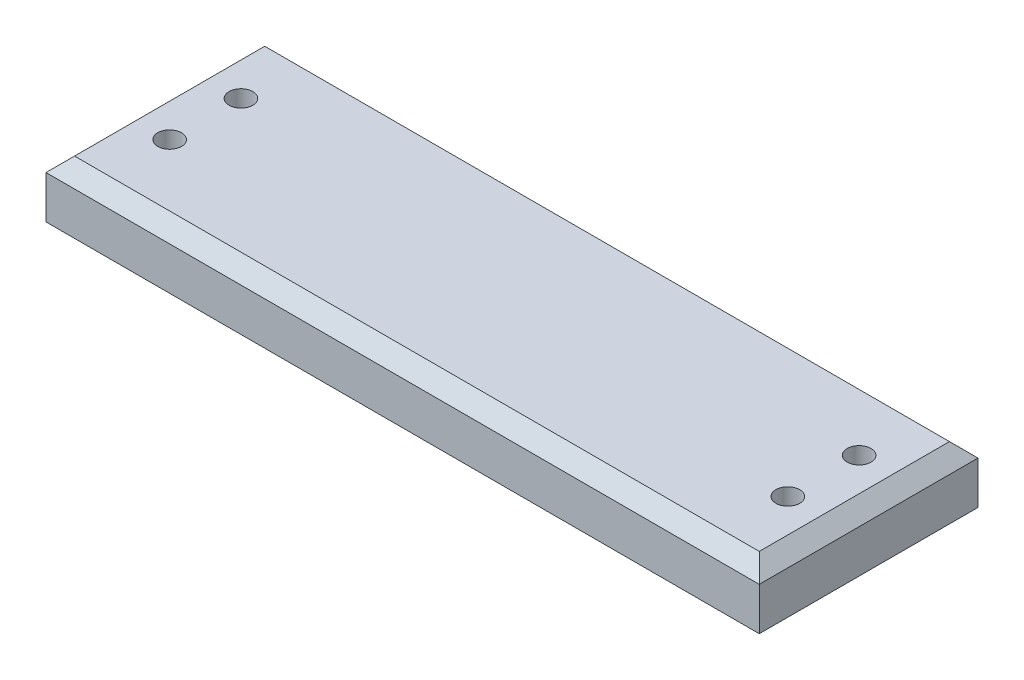
ISO-10303-21;
HEADER;
FILE_DESCRIPTION(('STEP AP214'),'2;1');
FILE_NAME('part.step','',(''),(''),'','','');
FILE_SCHEMA(('AUTOMOTIVE_DESIGN { 1 0 10303 214 1 1 1 1 }'));
ENDSEC;
DATA;
#1=APPLICATION_CONTEXT('core data for automotive mechanical design processes');
#2=APPLICATION_PROTOCOL_DEFINITION('international standard','automotive_design',2000,#1);
#3=PRODUCT_CONTEXT('',#1,'mechanical');
#4=PRODUCT('Part','Part','',(#3));
#5=PRODUCT_RELATED_PRODUCT_CATEGORY('part','',(#4));
#6=PRODUCT_DEFINITION_FORMATION('','',#4);
#7=PRODUCT_DEFINITION_CONTEXT('part definition',#1,'design');
#8=PRODUCT_DEFINITION('design','',#6,#7);
#9=PRODUCT_DEFINITION_SHAPE('','',#8);
#10=(LENGTH_UNIT() NAMED_UNIT(*) SI_UNIT(.MILLI.,.METRE.));
#11=(NAMED_UNIT(*) PLANE_ANGLE_UNIT() SI_UNIT($,.RADIAN.));
#12=(NAMED_UNIT(*) SI_UNIT($,.STERADIAN.) SOLID_ANGLE_UNIT());
#13=UNCERTAINTY_MEASURE_WITH_UNIT(LENGTH_MEASURE(1.E-05),#10,'distance_accuracy_value','');
#14=(GEOMETRIC_REPRESENTATION_CONTEXT(3) GLOBAL_UNCERTAINTY_ASSIGNED_CONTEXT((#13)) GLOBAL_UNIT_ASSIGNED_CONTEXT((#10,
#11,#12)) REPRESENTATION_CONTEXT('',''));
#15=CARTESIAN_POINT('',(0.,0.,0.));
#16=DIRECTION('',(0.,0.,1.));
#17=DIRECTION('',(1.,0.,0.));
#18=AXIS2_PLACEMENT_3D('',#15,#16,#17);
#19=CARTESIAN_POINT('',(1905.,304.8,584.2));
#20=DIRECTION('',(-1.,0.,0.));
#21=DIRECTION('',(0.,0.,1.));
#22=AXIS2_PLACEMENT_3D('',#19,#20,#21);
#23=PLANE('',#22);
#24=DIRECTION('',(0.,-1.,0.));
#25=VECTOR('',#24,1.);
#26=CARTESIAN_POINT('',(1905.,304.8,-584.2));
#27=LINE('',#26,#25);
#28=CARTESIAN_POINT('',(1905.,228.6,-584.2));
#29=VERTEX_POINT('',#28);
#30=CARTESIAN_POINT('',(1905.,0.,-584.2));
#31=VERTEX_POINT('',#30);
#32=EDGE_CURVE('E83',#29,#31,#27,.T.);
#33=ORIENTED_EDGE('',*,*,#32,.F.);
#34=DIRECTION('',(0.,0.,1.));
#35=VECTOR('',#34,1.);
#36=CARTESIAN_POINT('',(1905.,228.6,584.2));
#37=LINE('',#36,#35);
#38=CARTESIAN_POINT('',(1905.,228.6,584.2));
#39=VERTEX_POINT('',#38);
#40=EDGE_CURVE('E134',#29,#39,#37,.T.);
#41=ORIENTED_EDGE('',*,*,#40,.T.);
#42=DIRECTION('',(0.,-1.,0.));
#43=VECTOR('',#42,1.);
#44=CARTESIAN_POINT('',(1905.,304.8,584.2));
#45=LINE('',#44,#43);
#46=CARTESIAN_POINT('',(1905.,0.,584.2));
#47=VERTEX_POINT('',#46);
#48=EDGE_CURVE('E103',#39,#47,#45,.T.);
#49=ORIENTED_EDGE('',*,*,#48,.T.);
#50=DIRECTION('',(0.,0.,-1.));
#51=VECTOR('',#50,1.);
#52=CARTESIAN_POINT('',(1905.,0.,584.2));
#53=LINE('',#52,#51);
#54=EDGE_CURVE('E98',#47,#31,#53,.T.);
#55=ORIENTED_EDGE('',*,*,#54,.T.);
#56=EDGE_LOOP('',(#33,#41,#49,#55));
#57=FACE_BOUND('',#56,.T.);
#58=ADVANCED_FACE('F31',(#57),#23,.F.);
#59=CARTESIAN_POINT('',(-1905.,304.8,-584.2));
#60=DIRECTION('',(0.,0.,1.));
#61=DIRECTION('',(1.,0.,0.));
#62=AXIS2_PLACEMENT_3D('',#59,#60,#61);
#63=PLANE('',#62);
#64=DIRECTION('',(0.,-1.,0.));
#65=VECTOR('',#64,1.);
#66=CARTESIAN_POINT('',(-1905.,304.8,-584.2));
#67=LINE('',#66,#65);
#68=CARTESIAN_POINT('',(-1905.,228.6,-584.2));
#69=VERTEX_POINT('',#68);
#70=CARTESIAN_POINT('',(-1905.,0.,-584.2));
#71=VERTEX_POINT('',#70);
#72=EDGE_CURVE('E92',#69,#71,#67,.T.);
#73=ORIENTED_EDGE('',*,*,#72,.F.);
#74=DIRECTION('',(1.,0.,0.));
#75=VECTOR('',#74,1.);
#76=CARTESIAN_POINT('',(-1905.,228.6,-584.2));
#77=LINE('',#76,#75);
#78=EDGE_CURVE('E46',#69,#29,#77,.T.);
#79=ORIENTED_EDGE('',*,*,#78,.T.);
#80=ORIENTED_EDGE('',*,*,#32,.T.);
#81=DIRECTION('',(-1.,0.,0.));
#82=VECTOR('',#81,1.);
#83=CARTESIAN_POINT('',(-1905.,0.,-584.2));
#84=LINE('',#83,#82);
#85=EDGE_CURVE('E86',#31,#71,#84,.T.);
#86=ORIENTED_EDGE('',*,*,#85,.T.);
#87=EDGE_LOOP('',(#73,#79,#80,#86));
#88=FACE_BOUND('',#87,.T.);
#89=ADVANCED_FACE('F85',(#88),#63,.F.);
#90=CARTESIAN_POINT('',(-1905.,304.8,584.2));
#91=DIRECTION('',(1.,0.,0.));
#92=DIRECTION('',(0.,0.,-1.));
#93=AXIS2_PLACEMENT_3D('',#90,#91,#92);
#94=PLANE('',#93);
#95=DIRECTION('',(0.,-1.,0.));
#96=VECTOR('',#95,1.);
#97=CARTESIAN_POINT('',(-1905.,304.8,584.2));
#98=LINE('',#97,#96);
#99=CARTESIAN_POINT('',(-1905.,228.6,584.2));
#100=VERTEX_POINT('',#99);
#101=CARTESIAN_POINT('',(-1905.,0.,584.2));
#102=VERTEX_POINT('',#101);
#103=EDGE_CURVE('E118',#100,#102,#98,.T.);
#104=ORIENTED_EDGE('',*,*,#103,.F.);
#105=DIRECTION('',(0.,0.,-1.));
#106=VECTOR('',#105,1.);
#107=CARTESIAN_POINT('',(-1905.,228.6,584.2));
#108=LINE('',#107,#106);
#109=EDGE_CURVE('E54',#100,#69,#108,.T.);
#110=ORIENTED_EDGE('',*,*,#109,.T.);
#111=ORIENTED_EDGE('',*,*,#72,.T.);
#112=DIRECTION('',(0.,0.,1.));
#113=VECTOR('',#112,1.);
#114=CARTESIAN_POINT('',(-1905.,0.,584.2));
#115=LINE('',#114,#113);
#116=EDGE_CURVE('E100',#71,#102,#115,.T.);
#117=ORIENTED_EDGE('',*,*,#116,.T.);
#118=EDGE_LOOP('',(#104,#110,#111,#117));
#119=FACE_BOUND('',#118,.T.);
#120=ADVANCED_FACE('F189',(#119),#94,.F.);
#121=CARTESIAN_POINT('',(-1905.,304.8,584.2));
#122=DIRECTION('',(0.,0.,-1.));
#123=DIRECTION('',(-1.,0.,0.));
#124=AXIS2_PLACEMENT_3D('',#121,#122,#123);
#125=PLANE('',#124);
#126=ORIENTED_EDGE('',*,*,#48,.F.);
#127=DIRECTION('',(-1.,0.,0.));
#128=VECTOR('',#127,1.);
#129=CARTESIAN_POINT('',(-1905.,228.6,584.2));
#130=LINE('',#129,#128);
#131=EDGE_CURVE('E129',#39,#100,#130,.T.);
#132=ORIENTED_EDGE('',*,*,#131,.T.);
#133=ORIENTED_EDGE('',*,*,#103,.T.);
#134=DIRECTION('',(1.,0.,0.));
#135=VECTOR('',#134,1.);
#136=CARTESIAN_POINT('',(-1905.,0.,584.2));
#137=LINE('',#136,#135);
#138=EDGE_CURVE('E115',#102,#47,#137,.T.);
#139=ORIENTED_EDGE('',*,*,#138,.T.);
#140=EDGE_LOOP('',(#126,#132,#133,#139));
#141=FACE_BOUND('',#140,.T.);
#142=ADVANCED_FACE('F240',(#141),#125,.F.);
#143=CARTESIAN_POINT('',(1905.,304.8,-584.2));
#144=DIRECTION('',(0.,-1.,0.));
#145=DIRECTION('',(0.,0.,-1.));
#146=AXIS2_PLACEMENT_3D('',#143,#144,#145);
#147=PLANE('',#146);
#148=CARTESIAN_POINT('',(1651.,304.8,177.8));
#149=DIRECTION('',(0.,1.,0.));
#150=DIRECTION('',(0.,0.,1.));
#151=AXIS2_PLACEMENT_3D('',#148,#149,#150);
#152=CIRCLE('',#151,63.5000000000001);
#153=CARTESIAN_POINT('',(1651.,304.8,241.3));
#154=VERTEX_POINT('',#153);
#155=EDGE_CURVE('E232',#154,#154,#152,.T.);
#156=ORIENTED_EDGE('',*,*,#155,.F.);
#157=EDGE_LOOP('',(#156));
#158=FACE_BOUND('',#157,.T.);
#159=CARTESIAN_POINT('',(1651.,304.8,-203.2));
#160=DIRECTION('',(0.,1.,0.));
#161=DIRECTION('',(0.,0.,1.));
#162=AXIS2_PLACEMENT_3D('',#159,#160,#161);
#163=CIRCLE('',#162,63.5000000000001);
#164=CARTESIAN_POINT('',(1651.,304.8,-139.7));
#165=VERTEX_POINT('',#164);
#166=EDGE_CURVE('E229',#165,#165,#163,.T.);
#167=ORIENTED_EDGE('',*,*,#166,.F.);
#168=EDGE_LOOP('',(#167));
#169=FACE_BOUND('',#168,.T.);
#170=CARTESIAN_POINT('',(-1651.,304.8,-203.2));
#171=DIRECTION('',(0.,1.,0.));
#172=DIRECTION('',(0.,0.,1.));
#173=AXIS2_PLACEMENT_3D('',#170,#171,#172);
#174=CIRCLE('',#173,63.5000000000001);
#175=CARTESIAN_POINT('',(-1651.,304.8,-139.7));
#176=VERTEX_POINT('',#175);
#177=EDGE_CURVE('E231',#176,#176,#174,.T.);
#178=ORIENTED_EDGE('',*,*,#177,.F.);
#179=EDGE_LOOP('',(#178));
#180=FACE_BOUND('',#179,.T.);
#181=CARTESIAN_POINT('',(-1651.,304.8,177.8));
#182=DIRECTION('',(0.,1.,0.));
#183=DIRECTION('',(0.,0.,1.));
#184=AXIS2_PLACEMENT_3D('',#181,#182,#183);
#185=CIRCLE('',#184,63.5000000000001);
#186=CARTESIAN_POINT('',(-1651.,304.8,241.300000000001));
#187=VERTEX_POINT('',#186);
#188=EDGE_CURVE('E111',#187,#187,#185,.T.);
#189=ORIENTED_EDGE('',*,*,#188,.F.);
#190=EDGE_LOOP('',(#189));
#191=FACE_BOUND('',#190,.T.);
#192=DIRECTION('',(0.,0.,1.));
#193=VECTOR('',#192,1.);
#194=CARTESIAN_POINT('',(-1828.8,304.8,-584.2));
#195=LINE('',#194,#193);
#196=CARTESIAN_POINT('',(-1828.8,304.8,-508.));
#197=VERTEX_POINT('',#196);
#198=CARTESIAN_POINT('',(-1828.8,304.8,508.));
#199=VERTEX_POINT('',#198);
#200=EDGE_CURVE('E124',#197,#199,#195,.T.);
#201=ORIENTED_EDGE('',*,*,#200,.T.);
#202=DIRECTION('',(1.,0.,0.));
#203=VECTOR('',#202,1.);
#204=CARTESIAN_POINT('',(1905.,304.8,508.));
#205=LINE('',#204,#203);
#206=CARTESIAN_POINT('',(1828.8,304.8,508.));
#207=VERTEX_POINT('',#206);
#208=EDGE_CURVE('E126',#199,#207,#205,.T.);
#209=ORIENTED_EDGE('',*,*,#208,.T.);
#210=DIRECTION('',(0.,0.,-1.));
#211=VECTOR('',#210,1.);
#212=CARTESIAN_POINT('',(1828.8,304.8,-584.2));
#213=LINE('',#212,#211);
#214=CARTESIAN_POINT('',(1828.8,304.8,-508.));
#215=VERTEX_POINT('',#214);
#216=EDGE_CURVE('E91',#207,#215,#213,.T.);
#217=ORIENTED_EDGE('',*,*,#216,.T.);
#218=DIRECTION('',(-1.,0.,0.));
#219=VECTOR('',#218,1.);
#220=CARTESIAN_POINT('',(1905.,304.8,-508.));
#221=LINE('',#220,#219);
#222=EDGE_CURVE('E122',#215,#197,#221,.T.);
#223=ORIENTED_EDGE('',*,*,#222,.T.);
#224=EDGE_LOOP('',(#201,#209,#217,#223));
#225=FACE_BOUND('',#224,.T.);
#226=ADVANCED_FACE('F174',(#158,#169,#180,#191,#225),#147,.F.);
#227=CARTESIAN_POINT('',(1905.,0.,-584.2));
#228=DIRECTION('',(0.,-1.,0.));
#229=DIRECTION('',(0.,0.,-1.));
#230=AXIS2_PLACEMENT_3D('',#227,#228,#229);
#231=PLANE('',#230);
#232=CARTESIAN_POINT('',(-1651.,0.,-203.2));
#233=DIRECTION('',(0.,-1.,0.));
#234=DIRECTION('',(0.,0.,-1.));
#235=AXIS2_PLACEMENT_3D('',#232,#233,#234);
#236=CIRCLE('',#235,101.599999999998);
#237=CARTESIAN_POINT('',(-1651.,0.,-304.799999999998));
#238=VERTEX_POINT('',#237);
#239=EDGE_CURVE('E151',#238,#238,#236,.F.);
#240=ORIENTED_EDGE('',*,*,#239,.T.);
#241=EDGE_LOOP('',(#240));
#242=FACE_BOUND('',#241,.T.);
#243=CARTESIAN_POINT('',(1651.,0.,-203.2));
#244=DIRECTION('',(0.,-1.,0.));
#245=DIRECTION('',(0.,0.,-1.));
#246=AXIS2_PLACEMENT_3D('',#243,#244,#245);
#247=CIRCLE('',#246,101.599999999998);
#248=CARTESIAN_POINT('',(1651.,0.,-304.799999999998));
#249=VERTEX_POINT('',#248);
#250=EDGE_CURVE('E148',#249,#249,#247,.F.);
#251=ORIENTED_EDGE('',*,*,#250,.T.);
#252=EDGE_LOOP('',(#251));
#253=FACE_BOUND('',#252,.T.);
#254=CARTESIAN_POINT('',(1651.,0.,177.8));
#255=DIRECTION('',(0.,-1.,0.));
#256=DIRECTION('',(0.,0.,-1.));
#257=AXIS2_PLACEMENT_3D('',#254,#255,#256);
#258=CIRCLE('',#257,101.599999999998);
#259=CARTESIAN_POINT('',(1651.,0.,76.2000000000024));
#260=VERTEX_POINT('',#259);
#261=EDGE_CURVE('E145',#260,#260,#258,.F.);
#262=ORIENTED_EDGE('',*,*,#261,.T.);
#263=EDGE_LOOP('',(#262));
#264=FACE_BOUND('',#263,.T.);
#265=CARTESIAN_POINT('',(-1651.,0.,177.8));
#266=DIRECTION('',(0.,-1.,0.));
#267=DIRECTION('',(0.,0.,-1.));
#268=AXIS2_PLACEMENT_3D('',#265,#266,#267);
#269=CIRCLE('',#268,101.599999999998);
#270=CARTESIAN_POINT('',(-1651.,0.,76.2000000000028));
#271=VERTEX_POINT('',#270);
#272=EDGE_CURVE('E136',#271,#271,#269,.F.);
#273=ORIENTED_EDGE('',*,*,#272,.T.);
#274=EDGE_LOOP('',(#273));
#275=FACE_BOUND('',#274,.T.);
#276=ORIENTED_EDGE('',*,*,#54,.F.);
#277=ORIENTED_EDGE('',*,*,#138,.F.);
#278=ORIENTED_EDGE('',*,*,#116,.F.);
#279=ORIENTED_EDGE('',*,*,#85,.F.);
#280=EDGE_LOOP('',(#276,#277,#278,#279));
#281=FACE_BOUND('',#280,.T.);
#282=ADVANCED_FACE('F96',(#242,#253,#264,#275,#281),#231,.T.);
#283=CARTESIAN_POINT('',(1905.,304.8,-508.));
#284=DIRECTION('',(0.,-0.707106781186545,0.70710678118655));
#285=DIRECTION('',(0.,-0.70710678118655,-0.707106781186545));
#286=AXIS2_PLACEMENT_3D('',#283,#284,#285);
#287=PLANE('',#286);
#288=DIRECTION('',(-0.577350269189625,0.577350269189628,0.577350269189625));
#289=VECTOR('',#288,1.);
#290=CARTESIAN_POINT('',(1854.2,279.4,-533.4));
#291=LINE('',#290,#289);
#292=EDGE_CURVE('E108',#29,#215,#291,.T.);
#293=ORIENTED_EDGE('',*,*,#292,.F.);
#294=ORIENTED_EDGE('',*,*,#78,.F.);
#295=DIRECTION('',(0.577350269189625,0.577350269189628,0.577350269189625));
#296=VECTOR('',#295,1.);
#297=CARTESIAN_POINT('',(-584.200000000005,1549.4,736.599999999995));
#298=LINE('',#297,#296);
#299=EDGE_CURVE('E105',#197,#69,#298,.F.);
#300=ORIENTED_EDGE('',*,*,#299,.F.);
#301=ORIENTED_EDGE('',*,*,#222,.F.);
#302=EDGE_LOOP('',(#293,#294,#300,#301));
#303=FACE_BOUND('',#302,.T.);
#304=ADVANCED_FACE('F173',(#303),#287,.F.);
#305=CARTESIAN_POINT('',(-1828.8,304.8,-584.2));
#306=DIRECTION('',(0.70710678118655,-0.707106781186545,0.));
#307=DIRECTION('',(0.707106781186545,0.70710678118655,0.));
#308=AXIS2_PLACEMENT_3D('',#305,#306,#307);
#309=PLANE('',#308);
#310=ORIENTED_EDGE('',*,*,#299,.T.);
#311=ORIENTED_EDGE('',*,*,#109,.F.);
#312=DIRECTION('',(0.577350269189625,0.577350269189628,-0.577350269189625));
#313=VECTOR('',#312,1.);
#314=CARTESIAN_POINT('',(-1464.73333333333,668.866666666667,143.933333333335));
#315=LINE('',#314,#313);
#316=EDGE_CURVE('E139',#199,#100,#315,.F.);
#317=ORIENTED_EDGE('',*,*,#316,.F.);
#318=ORIENTED_EDGE('',*,*,#200,.F.);
#319=EDGE_LOOP('',(#310,#311,#317,#318));
#320=FACE_BOUND('',#319,.T.);
#321=ADVANCED_FACE('F201',(#320),#309,.F.);
#322=CARTESIAN_POINT('',(1828.8,304.8,-584.2));
#323=DIRECTION('',(-0.70710678118655,-0.707106781186545,0.));
#324=DIRECTION('',(0.707106781186545,-0.70710678118655,0.));
#325=AXIS2_PLACEMENT_3D('',#322,#323,#324);
#326=PLANE('',#325);
#327=ORIENTED_EDGE('',*,*,#292,.T.);
#328=ORIENTED_EDGE('',*,*,#216,.F.);
#329=DIRECTION('',(0.577350269189625,-0.577350269189628,0.577350269189625));
#330=VECTOR('',#329,1.);
#331=CARTESIAN_POINT('',(1464.73333333333,668.866666666667,143.933333333335));
#332=LINE('',#331,#330);
#333=EDGE_CURVE('E137',#39,#207,#332,.F.);
#334=ORIENTED_EDGE('',*,*,#333,.F.);
#335=ORIENTED_EDGE('',*,*,#40,.F.);
#336=EDGE_LOOP('',(#327,#328,#334,#335));
#337=FACE_BOUND('',#336,.T.);
#338=ADVANCED_FACE('F197',(#337),#326,.F.);
#339=CARTESIAN_POINT('',(1905.,304.8,508.));
#340=DIRECTION('',(0.,-0.707106781186545,-0.70710678118655));
#341=DIRECTION('',(0.,0.70710678118655,-0.707106781186545));
#342=AXIS2_PLACEMENT_3D('',#339,#340,#341);
#343=PLANE('',#342);
#344=ORIENTED_EDGE('',*,*,#316,.T.);
#345=ORIENTED_EDGE('',*,*,#131,.F.);
#346=ORIENTED_EDGE('',*,*,#333,.T.);
#347=ORIENTED_EDGE('',*,*,#208,.F.);
#348=EDGE_LOOP('',(#344,#345,#346,#347));
#349=FACE_BOUND('',#348,.T.);
#350=ADVANCED_FACE('F193',(#349),#343,.F.);
#351=CARTESIAN_POINT('',(-1651.,0.,177.8));
#352=DIRECTION('',(0.,1.,0.));
#353=DIRECTION('',(0.,0.,1.));
#354=AXIS2_PLACEMENT_3D('',#351,#352,#353);
#355=CYLINDRICAL_SURFACE('',#354,63.5000000000001);
#356=CARTESIAN_POINT('',(-1651.,38.0999999999978,177.8));
#357=DIRECTION('',(0.,-1.,0.));
#358=DIRECTION('',(0.,0.,-1.));
#359=AXIS2_PLACEMENT_3D('',#356,#357,#358);
#360=CIRCLE('',#359,63.5000000000001);
#361=CARTESIAN_POINT('',(-1651.,38.0999999999978,114.3));
#362=VERTEX_POINT('',#361);
#363=EDGE_CURVE('E11',#362,#362,#360,.T.);
#364=ORIENTED_EDGE('',*,*,#363,.T.);
#365=EDGE_LOOP('',(#364));
#366=FACE_BOUND('',#365,.T.);
#367=ORIENTED_EDGE('',*,*,#188,.T.);
#368=EDGE_LOOP('',(#367));
#369=FACE_BOUND('',#368,.T.);
#370=ADVANCED_FACE('F196',(#366,#369),#355,.F.);
#371=CARTESIAN_POINT('',(-1651.,0.,-203.2));
#372=DIRECTION('',(0.,1.,0.));
#373=DIRECTION('',(0.,0.,1.));
#374=AXIS2_PLACEMENT_3D('',#371,#372,#373);
#375=CYLINDRICAL_SURFACE('',#374,63.5000000000001);
#376=CARTESIAN_POINT('',(-1651.,38.0999999999979,-203.2));
#377=DIRECTION('',(0.,-1.,0.));
#378=DIRECTION('',(0.,0.,-1.));
#379=AXIS2_PLACEMENT_3D('',#376,#377,#378);
#380=CIRCLE('',#379,63.5000000000001);
#381=CARTESIAN_POINT('',(-1651.,38.0999999999979,-266.7));
#382=VERTEX_POINT('',#381);
#383=EDGE_CURVE('E154',#382,#382,#380,.T.);
#384=ORIENTED_EDGE('',*,*,#383,.T.);
#385=EDGE_LOOP('',(#384));
#386=FACE_BOUND('',#385,.T.);
#387=ORIENTED_EDGE('',*,*,#177,.T.);
#388=EDGE_LOOP('',(#387));
#389=FACE_BOUND('',#388,.T.);
#390=ADVANCED_FACE('F225',(#386,#389),#375,.F.);
#391=CARTESIAN_POINT('',(1651.,0.,-203.2));
#392=DIRECTION('',(0.,1.,0.));
#393=DIRECTION('',(0.,0.,1.));
#394=AXIS2_PLACEMENT_3D('',#391,#392,#393);
#395=CYLINDRICAL_SURFACE('',#394,63.5000000000001);
#396=CARTESIAN_POINT('',(1651.,38.0999999999979,-203.2));
#397=DIRECTION('',(0.,-1.,0.));
#398=DIRECTION('',(0.,0.,-1.));
#399=AXIS2_PLACEMENT_3D('',#396,#397,#398);
#400=CIRCLE('',#399,63.5000000000001);
#401=CARTESIAN_POINT('',(1651.,38.0999999999979,-266.7));
#402=VERTEX_POINT('',#401);
#403=EDGE_CURVE('E157',#402,#402,#400,.T.);
#404=ORIENTED_EDGE('',*,*,#403,.T.);
#405=EDGE_LOOP('',(#404));
#406=FACE_BOUND('',#405,.T.);
#407=ORIENTED_EDGE('',*,*,#166,.T.);
#408=EDGE_LOOP('',(#407));
#409=FACE_BOUND('',#408,.T.);
#410=ADVANCED_FACE('F222',(#406,#409),#395,.F.);
#411=CARTESIAN_POINT('',(1651.,0.,177.8));
#412=DIRECTION('',(0.,1.,0.));
#413=DIRECTION('',(0.,0.,1.));
#414=AXIS2_PLACEMENT_3D('',#411,#412,#413);
#415=CYLINDRICAL_SURFACE('',#414,63.5000000000001);
#416=CARTESIAN_POINT('',(1651.,38.0999999999978,177.8));
#417=DIRECTION('',(0.,-1.,0.));
#418=DIRECTION('',(0.,0.,-1.));
#419=AXIS2_PLACEMENT_3D('',#416,#417,#418);
#420=CIRCLE('',#419,63.5000000000001);
#421=CARTESIAN_POINT('',(1651.,38.0999999999978,114.3));
#422=VERTEX_POINT('',#421);
#423=EDGE_CURVE('E39',#422,#422,#420,.T.);
#424=ORIENTED_EDGE('',*,*,#423,.T.);
#425=EDGE_LOOP('',(#424));
#426=FACE_BOUND('',#425,.T.);
#427=ORIENTED_EDGE('',*,*,#155,.T.);
#428=EDGE_LOOP('',(#427));
#429=FACE_BOUND('',#428,.T.);
#430=ADVANCED_FACE('F162',(#426,#429),#415,.F.);
#431=CARTESIAN_POINT('',(-1651.,0.,-203.2));
#432=DIRECTION('',(0.,-1.,0.));
#433=DIRECTION('',(0.,0.,-1.));
#434=AXIS2_PLACEMENT_3D('',#431,#432,#433);
#435=CONICAL_SURFACE('',#434,101.599999999998,0.785398163397444);
#436=ORIENTED_EDGE('',*,*,#383,.F.);
#437=EDGE_LOOP('',(#436));
#438=FACE_BOUND('',#437,.T.);
#439=ORIENTED_EDGE('',*,*,#239,.F.);
#440=EDGE_LOOP('',(#439));
#441=FACE_BOUND('',#440,.T.);
#442=ADVANCED_FACE('F209',(#438,#441),#435,.F.);
#443=CARTESIAN_POINT('',(1651.,0.,-203.2));
#444=DIRECTION('',(0.,-1.,0.));
#445=DIRECTION('',(0.,0.,-1.));
#446=AXIS2_PLACEMENT_3D('',#443,#444,#445);
#447=CONICAL_SURFACE('',#446,101.599999999998,0.785398163397444);
#448=ORIENTED_EDGE('',*,*,#403,.F.);
#449=EDGE_LOOP('',(#448));
#450=FACE_BOUND('',#449,.T.);
#451=ORIENTED_EDGE('',*,*,#250,.F.);
#452=EDGE_LOOP('',(#451));
#453=FACE_BOUND('',#452,.T.);
#454=ADVANCED_FACE('F168',(#450,#453),#447,.F.);
#455=CARTESIAN_POINT('',(1651.,0.,177.8));
#456=DIRECTION('',(0.,-1.,0.));
#457=DIRECTION('',(0.,0.,-1.));
#458=AXIS2_PLACEMENT_3D('',#455,#456,#457);
#459=CONICAL_SURFACE('',#458,101.599999999998,0.785398163397445);
#460=ORIENTED_EDGE('',*,*,#423,.F.);
#461=EDGE_LOOP('',(#460));
#462=FACE_BOUND('',#461,.T.);
#463=ORIENTED_EDGE('',*,*,#261,.F.);
#464=EDGE_LOOP('',(#463));
#465=FACE_BOUND('',#464,.T.);
#466=ADVANCED_FACE('F165',(#462,#465),#459,.F.);
#467=CARTESIAN_POINT('',(-1651.,0.,177.8));
#468=DIRECTION('',(0.,-1.,0.));
#469=DIRECTION('',(0.,0.,-1.));
#470=AXIS2_PLACEMENT_3D('',#467,#468,#469);
#471=CONICAL_SURFACE('',#470,101.599999999998,0.785398163397445);
#472=ORIENTED_EDGE('',*,*,#363,.F.);
#473=EDGE_LOOP('',(#472));
#474=FACE_BOUND('',#473,.T.);
#475=ORIENTED_EDGE('',*,*,#272,.F.);
#476=EDGE_LOOP('',(#475));
#477=FACE_BOUND('',#476,.T.);
#478=ADVANCED_FACE('F33',(#474,#477),#471,.F.);
#479=CLOSED_SHELL('',(#58,#89,#120,#142,#226,#282,#304,#321,#338,#350,#370,#390,#410,#430,#442,
#454,#466,#478));
#480=MANIFOLD_SOLID_BREP('B2',#479);
#481=ADVANCED_BREP_SHAPE_REPRESENTATION('',(#18,#480),#14);
#482=SHAPE_DEFINITION_REPRESENTATION(#9,#481);
ENDSEC;
END-ISO-10303-21;
